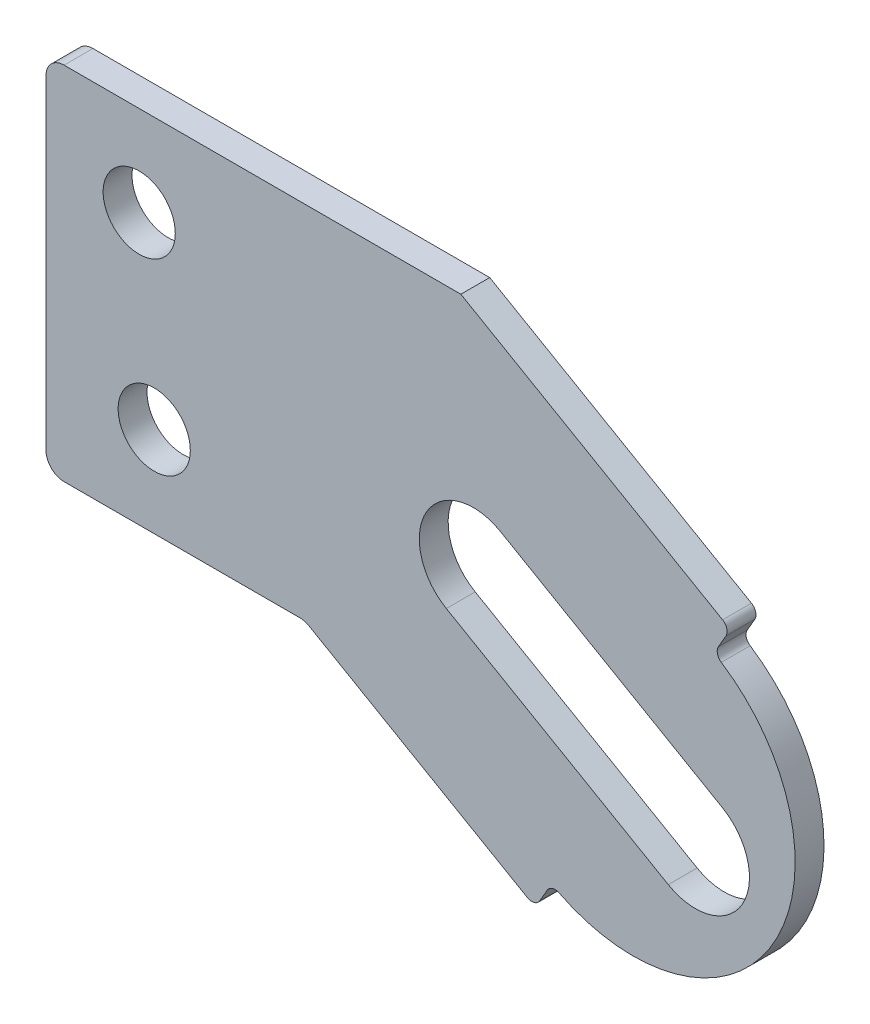
ISO-10303-21;
HEADER;
FILE_DESCRIPTION(('STEP AP214'),'2;1');
FILE_NAME('part.step','',(''),(''),'','','');
FILE_SCHEMA(('AUTOMOTIVE_DESIGN { 1 0 10303 214 1 1 1 1 }'));
ENDSEC;
DATA;
#1=APPLICATION_CONTEXT('core data for automotive mechanical design processes');
#2=APPLICATION_PROTOCOL_DEFINITION('international standard','automotive_design',2000,#1);
#3=PRODUCT_CONTEXT('',#1,'mechanical');
#4=PRODUCT('Part','Part','',(#3));
#5=PRODUCT_RELATED_PRODUCT_CATEGORY('part','',(#4));
#6=PRODUCT_DEFINITION_FORMATION('','',#4);
#7=PRODUCT_DEFINITION_CONTEXT('part definition',#1,'design');
#8=PRODUCT_DEFINITION('design','',#6,#7);
#9=PRODUCT_DEFINITION_SHAPE('','',#8);
#10=(LENGTH_UNIT() NAMED_UNIT(*) SI_UNIT(.MILLI.,.METRE.));
#11=(NAMED_UNIT(*) PLANE_ANGLE_UNIT() SI_UNIT($,.RADIAN.));
#12=(NAMED_UNIT(*) SI_UNIT($,.STERADIAN.) SOLID_ANGLE_UNIT());
#13=UNCERTAINTY_MEASURE_WITH_UNIT(LENGTH_MEASURE(1.E-05),#10,'distance_accuracy_value','');
#14=(GEOMETRIC_REPRESENTATION_CONTEXT(3) GLOBAL_UNCERTAINTY_ASSIGNED_CONTEXT((#13)) GLOBAL_UNIT_ASSIGNED_CONTEXT((#10,
#11,#12)) REPRESENTATION_CONTEXT('',''));
#15=CARTESIAN_POINT('',(0.,0.,0.));
#16=DIRECTION('',(0.,0.,1.));
#17=DIRECTION('',(1.,0.,0.));
#18=AXIS2_PLACEMENT_3D('',#15,#16,#17);
#19=CARTESIAN_POINT('',(0.15720945239991,1.39829475898672,0.2));
#20=DIRECTION('',(0.,0.,1.));
#21=DIRECTION('',(1.,0.,0.));
#22=AXIS2_PLACEMENT_3D('',#19,#20,#21);
#23=PLANE('',#22);
#24=CARTESIAN_POINT('',(-3.85411977486092,1.875,0.2));
#25=DIRECTION('',(0.,0.,1.));
#26=DIRECTION('',(1.,0.,0.));
#27=AXIS2_PLACEMENT_3D('',#24,#25,#26);
#28=CIRCLE('',#27,0.25);
#29=CARTESIAN_POINT('',(-3.60411977486092,1.875,0.2));
#30=VERTEX_POINT('',#29);
#31=EDGE_CURVE('E227',#30,#30,#28,.T.);
#32=ORIENTED_EDGE('',*,*,#31,.F.);
#33=EDGE_LOOP('',(#32));
#34=FACE_BOUND('',#33,.T.);
#35=DIRECTION('',(-0.866025403784438,0.500000000000001,0.));
#36=VECTOR('',#35,1.);
#37=CARTESIAN_POINT('',(-1.625,2.5,0.2));
#38=LINE('',#37,#36);
#39=CARTESIAN_POINT('',(0.188709452399909,1.45285435942514,0.2));
#40=VERTEX_POINT('',#39);
#41=CARTESIAN_POINT('',(-1.625,2.5,0.2));
#42=VERTEX_POINT('',#41);
#43=EDGE_CURVE('E235',#40,#42,#38,.T.);
#44=ORIENTED_EDGE('',*,*,#43,.T.);
#45=DIRECTION('',(-1.,0.,0.));
#46=VECTOR('',#45,1.);
#47=CARTESIAN_POINT('',(-4.375,2.5,0.2));
#48=LINE('',#47,#46);
#49=CARTESIAN_POINT('',(-4.375,2.5,0.2));
#50=VERTEX_POINT('',#49);
#51=EDGE_CURVE('E239',#42,#50,#48,.T.);
#52=ORIENTED_EDGE('',*,*,#51,.T.);
#53=CARTESIAN_POINT('',(-4.375,2.375,0.2));
#54=DIRECTION('',(0.,0.,1.));
#55=DIRECTION('',(-1.,0.,0.));
#56=AXIS2_PLACEMENT_3D('',#53,#54,#55);
#57=CIRCLE('',#56,0.125);
#58=CARTESIAN_POINT('',(-4.5,2.375,0.2));
#59=VERTEX_POINT('',#58);
#60=EDGE_CURVE('E243',#50,#59,#57,.T.);
#61=ORIENTED_EDGE('',*,*,#60,.T.);
#62=DIRECTION('',(0.,-1.,0.));
#63=VECTOR('',#62,1.);
#64=CARTESIAN_POINT('',(-4.5,2.375,0.2));
#65=LINE('',#64,#63);
#66=CARTESIAN_POINT('',(-4.5,0.125000000000001,0.2));
#67=VERTEX_POINT('',#66);
#68=EDGE_CURVE('E246',#59,#67,#65,.T.);
#69=ORIENTED_EDGE('',*,*,#68,.T.);
#70=CARTESIAN_POINT('',(-4.375,0.125,0.2));
#71=DIRECTION('',(0.,0.,1.));
#72=DIRECTION('',(1.,0.,0.));
#73=AXIS2_PLACEMENT_3D('',#70,#71,#72);
#74=CIRCLE('',#73,0.125);
#75=CARTESIAN_POINT('',(-4.375,0.,0.2));
#76=VERTEX_POINT('',#75);
#77=EDGE_CURVE('E249',#67,#76,#74,.T.);
#78=ORIENTED_EDGE('',*,*,#77,.T.);
#79=DIRECTION('',(1.,0.,0.));
#80=VECTOR('',#79,1.);
#81=CARTESIAN_POINT('',(-4.375,0.,0.2));
#82=LINE('',#81,#80);
#83=CARTESIAN_POINT('',(-2.7403666301317,0.,0.2));
#84=VERTEX_POINT('',#83);
#85=EDGE_CURVE('E252',#76,#84,#82,.T.);
#86=ORIENTED_EDGE('',*,*,#85,.T.);
#87=CARTESIAN_POINT('',(-2.7403666301317,-0.125,0.2));
#88=DIRECTION('',(0.,0.,-1.));
#89=DIRECTION('',(-1.,0.,0.));
#90=AXIS2_PLACEMENT_3D('',#87,#88,#89);
#91=CIRCLE('',#90,0.125);
#92=CARTESIAN_POINT('',(-2.6778666301317,-0.0167468245269457,0.2));
#93=VERTEX_POINT('',#92);
#94=EDGE_CURVE('E255',#84,#93,#91,.T.);
#95=ORIENTED_EDGE('',*,*,#94,.T.);
#96=DIRECTION('',(0.866025403784438,-0.500000000000001,0.));
#97=VECTOR('',#96,1.);
#98=CARTESIAN_POINT('',(-2.6778666301317,-0.0167468245269454,0.2));
#99=LINE('',#98,#97);
#100=CARTESIAN_POINT('',(-1.16429054760009,-0.890610383215549,0.2));
#101=VERTEX_POINT('',#100);
#102=EDGE_CURVE('E258',#93,#101,#99,.T.);
#103=ORIENTED_EDGE('',*,*,#102,.T.);
#104=CARTESIAN_POINT('',(-1.13279054760009,-0.836050782777129,0.2));
#105=DIRECTION('',(0.,0.,1.));
#106=DIRECTION('',(1.,0.,0.));
#107=AXIS2_PLACEMENT_3D('',#104,#105,#106);
#108=CIRCLE('',#107,0.0629999999999999);
#109=CARTESIAN_POINT('',(-1.07823094716167,-0.867550782777129,0.2));
#110=VERTEX_POINT('',#109);
#111=EDGE_CURVE('E261',#101,#110,#108,.T.);
#112=ORIENTED_EDGE('',*,*,#111,.T.);
#113=DIRECTION('',(0.5,0.866025403784439,0.));
#114=VECTOR('',#113,1.);
#115=CARTESIAN_POINT('',(-1.07823094716167,-0.867550782777129,0.2));
#116=LINE('',#115,#114);
#117=CARTESIAN_POINT('',(-1.02639513185256,-0.777768517009981,0.2));
#118=VERTEX_POINT('',#117);
#119=EDGE_CURVE('E264',#110,#118,#116,.T.);
#120=ORIENTED_EDGE('',*,*,#119,.T.);
#121=CARTESIAN_POINT('',(-0.971835531414136,-0.809268517009981,0.2));
#122=DIRECTION('',(0.,0.,-1.));
#123=DIRECTION('',(1.,0.,0.));
#124=AXIS2_PLACEMENT_3D('',#121,#122,#123);
#125=CIRCLE('',#124,0.0629999999999999);
#126=CARTESIAN_POINT('',(-0.943273167097718,-0.753115232647834,0.2));
#127=VERTEX_POINT('',#126);
#128=EDGE_CURVE('E267',#118,#127,#125,.T.);
#129=ORIENTED_EDGE('',*,*,#128,.T.);
#130=CARTESIAN_POINT('',(-0.433230947161672,0.249621988104797,0.2));
#131=DIRECTION('',(0.,0.,1.));
#132=DIRECTION('',(-1.,0.,0.));
#133=AXIS2_PLACEMENT_3D('',#130,#131,#132);
#134=CIRCLE('',#133,1.125);
#135=CARTESIAN_POINT('',(0.180143849362289,1.19270011794834,0.2));
#136=VERTEX_POINT('',#135);
#137=EDGE_CURVE('E270',#127,#136,#134,.T.);
#138=ORIENTED_EDGE('',*,*,#137,.T.);
#139=CARTESIAN_POINT('',(0.214492837967631,1.24551249321957,0.2));
#140=DIRECTION('',(0.,0.,-1.));
#141=DIRECTION('',(1.,0.,0.));
#142=AXIS2_PLACEMENT_3D('',#139,#140,#141);
#143=CIRCLE('',#142,0.0630000000000001);
#144=CARTESIAN_POINT('',(0.159933237529212,1.27701249321957,0.2));
#145=VERTEX_POINT('',#144);
#146=EDGE_CURVE('E273',#136,#145,#143,.T.);
#147=ORIENTED_EDGE('',*,*,#146,.T.);
#148=DIRECTION('',(0.500000000000001,0.866025403784438,0.));
#149=VECTOR('',#148,1.);
#150=CARTESIAN_POINT('',(0.211769052838329,1.36679475898672,0.2));
#151=LINE('',#150,#149);
#152=CARTESIAN_POINT('',(0.211769052838329,1.36679475898672,0.2));
#153=VERTEX_POINT('',#152);
#154=EDGE_CURVE('E276',#145,#153,#151,.T.);
#155=ORIENTED_EDGE('',*,*,#154,.T.);
#156=CARTESIAN_POINT('',(0.15720945239991,1.39829475898672,0.2));
#157=DIRECTION('',(0.,0.,1.));
#158=DIRECTION('',(1.,0.,0.));
#159=AXIS2_PLACEMENT_3D('',#156,#157,#158);
#160=CIRCLE('',#159,0.0629999999999997);
#161=EDGE_CURVE('E279',#153,#40,#160,.T.);
#162=ORIENTED_EDGE('',*,*,#161,.T.);
#163=EDGE_LOOP('',(#44,#52,#61,#69,#78,#86,#95,#103,#112,#120,#129,#138,#147,#155,#162));
#164=FACE_BOUND('',#163,.T.);
#165=CARTESIAN_POINT('',(-3.75,0.625,0.2));
#166=DIRECTION('',(0.,0.,1.));
#167=DIRECTION('',(1.,0.,0.));
#168=AXIS2_PLACEMENT_3D('',#165,#166,#167);
#169=CIRCLE('',#168,0.25);
#170=CARTESIAN_POINT('',(-3.5,0.625,0.2));
#171=VERTEX_POINT('',#170);
#172=EDGE_CURVE('E219',#171,#171,#169,.T.);
#173=ORIENTED_EDGE('',*,*,#172,.F.);
#174=EDGE_LOOP('',(#173));
#175=FACE_BOUND('',#174,.T.);
#176=DIRECTION('',(-0.866025403784438,0.500000000000001,0.));
#177=VECTOR('',#176,1.);
#178=CARTESIAN_POINT('',(0.1875,0.324759526419164,0.2));
#179=LINE('',#178,#177);
#180=CARTESIAN_POINT('',(0.1875,0.324759526419164,0.2));
#181=VERTEX_POINT('',#180);
#182=CARTESIAN_POINT('',(-1.35059503581098,1.21277910938386,0.2));
#183=VERTEX_POINT('',#182);
#184=EDGE_CURVE('E180',#181,#183,#179,.T.);
#185=ORIENTED_EDGE('',*,*,#184,.F.);
#186=CARTESIAN_POINT('',(0.,0.,0.2));
#187=DIRECTION('',(0.,0.,1.));
#188=DIRECTION('',(1.,0.,0.));
#189=AXIS2_PLACEMENT_3D('',#186,#187,#188);
#190=CIRCLE('',#189,0.375);
#191=CARTESIAN_POINT('',(-0.1875,-0.324759526419164,0.2));
#192=VERTEX_POINT('',#191);
#193=EDGE_CURVE('E171',#192,#181,#190,.T.);
#194=ORIENTED_EDGE('',*,*,#193,.F.);
#195=DIRECTION('',(0.866025403784438,-0.500000000000001,0.));
#196=VECTOR('',#195,1.);
#197=CARTESIAN_POINT('',(-0.1875,-0.324759526419164,0.2));
#198=LINE('',#197,#196);
#199=CARTESIAN_POINT('',(-1.72559503581098,0.563260056545533,0.2));
#200=VERTEX_POINT('',#199);
#201=EDGE_CURVE('E197',#200,#192,#198,.T.);
#202=ORIENTED_EDGE('',*,*,#201,.F.);
#203=CARTESIAN_POINT('',(-1.53809503581098,0.888019582964697,0.2));
#204=DIRECTION('',(0.,0.,1.));
#205=DIRECTION('',(1.,0.,0.));
#206=AXIS2_PLACEMENT_3D('',#203,#204,#205);
#207=CIRCLE('',#206,0.375);
#208=EDGE_CURVE('E193',#183,#200,#207,.T.);
#209=ORIENTED_EDGE('',*,*,#208,.F.);
#210=EDGE_LOOP('',(#185,#194,#202,#209));
#211=FACE_BOUND('',#210,.T.);
#212=ADVANCED_FACE('F39',(#34,#164,#175,#211),#23,.T.);
#213=CARTESIAN_POINT('',(0.15720945239991,1.39829475898672,0.));
#214=DIRECTION('',(0.,0.,1.));
#215=DIRECTION('',(1.,0.,0.));
#216=AXIS2_PLACEMENT_3D('',#213,#214,#215);
#217=PLANE('',#216);
#218=CARTESIAN_POINT('',(-3.75,0.625,0.));
#219=DIRECTION('',(0.,0.,1.));
#220=DIRECTION('',(1.,0.,0.));
#221=AXIS2_PLACEMENT_3D('',#218,#219,#220);
#222=CIRCLE('',#221,0.25);
#223=CARTESIAN_POINT('',(-3.5,0.625,0.));
#224=VERTEX_POINT('',#223);
#225=EDGE_CURVE('E189',#224,#224,#222,.T.);
#226=ORIENTED_EDGE('',*,*,#225,.T.);
#227=EDGE_LOOP('',(#226));
#228=FACE_BOUND('',#227,.T.);
#229=CARTESIAN_POINT('',(-3.85411977486092,1.875,0.));
#230=DIRECTION('',(0.,0.,1.));
#231=DIRECTION('',(1.,0.,0.));
#232=AXIS2_PLACEMENT_3D('',#229,#230,#231);
#233=CIRCLE('',#232,0.25);
#234=CARTESIAN_POINT('',(-3.60411977486092,1.875,0.));
#235=VERTEX_POINT('',#234);
#236=EDGE_CURVE('E223',#235,#235,#233,.T.);
#237=ORIENTED_EDGE('',*,*,#236,.T.);
#238=EDGE_LOOP('',(#237));
#239=FACE_BOUND('',#238,.T.);
#240=DIRECTION('',(-0.866025403784438,0.500000000000001,0.));
#241=VECTOR('',#240,1.);
#242=CARTESIAN_POINT('',(-1.625,2.5,0.));
#243=LINE('',#242,#241);
#244=CARTESIAN_POINT('',(0.188709452399909,1.45285435942514,0.));
#245=VERTEX_POINT('',#244);
#246=CARTESIAN_POINT('',(-1.625,2.5,0.));
#247=VERTEX_POINT('',#246);
#248=EDGE_CURVE('E231',#245,#247,#243,.T.);
#249=ORIENTED_EDGE('',*,*,#248,.F.);
#250=CARTESIAN_POINT('',(0.15720945239991,1.39829475898672,0.));
#251=DIRECTION('',(0.,0.,1.));
#252=DIRECTION('',(1.,0.,0.));
#253=AXIS2_PLACEMENT_3D('',#250,#251,#252);
#254=CIRCLE('',#253,0.0629999999999997);
#255=CARTESIAN_POINT('',(0.211769052838329,1.36679475898672,0.));
#256=VERTEX_POINT('',#255);
#257=EDGE_CURVE('E240',#256,#245,#254,.T.);
#258=ORIENTED_EDGE('',*,*,#257,.F.);
#259=DIRECTION('',(0.500000000000001,0.866025403784438,0.));
#260=VECTOR('',#259,1.);
#261=CARTESIAN_POINT('',(0.211769052838329,1.36679475898672,0.));
#262=LINE('',#261,#260);
#263=CARTESIAN_POINT('',(0.159933237529212,1.27701249321957,0.));
#264=VERTEX_POINT('',#263);
#265=EDGE_CURVE('E322',#264,#256,#262,.T.);
#266=ORIENTED_EDGE('',*,*,#265,.F.);
#267=CARTESIAN_POINT('',(0.214492837967631,1.24551249321957,0.));
#268=DIRECTION('',(0.,0.,-1.));
#269=DIRECTION('',(1.,0.,0.));
#270=AXIS2_PLACEMENT_3D('',#267,#268,#269);
#271=CIRCLE('',#270,0.0630000000000001);
#272=CARTESIAN_POINT('',(0.180143849362289,1.19270011794834,0.));
#273=VERTEX_POINT('',#272);
#274=EDGE_CURVE('E319',#273,#264,#271,.T.);
#275=ORIENTED_EDGE('',*,*,#274,.F.);
#276=CARTESIAN_POINT('',(-0.433230947161672,0.249621988104797,0.));
#277=DIRECTION('',(0.,0.,1.));
#278=DIRECTION('',(-1.,0.,0.));
#279=AXIS2_PLACEMENT_3D('',#276,#277,#278);
#280=CIRCLE('',#279,1.125);
#281=CARTESIAN_POINT('',(-0.943273167097718,-0.753115232647834,0.));
#282=VERTEX_POINT('',#281);
#283=EDGE_CURVE('E316',#282,#273,#280,.T.);
#284=ORIENTED_EDGE('',*,*,#283,.F.);
#285=CARTESIAN_POINT('',(-0.971835531414136,-0.809268517009981,0.));
#286=DIRECTION('',(0.,0.,-1.));
#287=DIRECTION('',(1.,0.,0.));
#288=AXIS2_PLACEMENT_3D('',#285,#286,#287);
#289=CIRCLE('',#288,0.0629999999999999);
#290=CARTESIAN_POINT('',(-1.02639513185256,-0.777768517009981,0.));
#291=VERTEX_POINT('',#290);
#292=EDGE_CURVE('E313',#291,#282,#289,.T.);
#293=ORIENTED_EDGE('',*,*,#292,.F.);
#294=DIRECTION('',(0.5,0.866025403784439,0.));
#295=VECTOR('',#294,1.);
#296=CARTESIAN_POINT('',(-1.07823094716167,-0.867550782777129,0.));
#297=LINE('',#296,#295);
#298=CARTESIAN_POINT('',(-1.07823094716167,-0.867550782777129,0.));
#299=VERTEX_POINT('',#298);
#300=EDGE_CURVE('E310',#299,#291,#297,.T.);
#301=ORIENTED_EDGE('',*,*,#300,.F.);
#302=CARTESIAN_POINT('',(-1.13279054760009,-0.836050782777129,0.));
#303=DIRECTION('',(0.,0.,1.));
#304=DIRECTION('',(1.,0.,0.));
#305=AXIS2_PLACEMENT_3D('',#302,#303,#304);
#306=CIRCLE('',#305,0.0629999999999999);
#307=CARTESIAN_POINT('',(-1.16429054760009,-0.890610383215549,0.));
#308=VERTEX_POINT('',#307);
#309=EDGE_CURVE('E307',#308,#299,#306,.T.);
#310=ORIENTED_EDGE('',*,*,#309,.F.);
#311=DIRECTION('',(0.866025403784438,-0.500000000000001,0.));
#312=VECTOR('',#311,1.);
#313=CARTESIAN_POINT('',(-2.6778666301317,-0.0167468245269454,0.));
#314=LINE('',#313,#312);
#315=CARTESIAN_POINT('',(-2.6778666301317,-0.0167468245269457,0.));
#316=VERTEX_POINT('',#315);
#317=EDGE_CURVE('E304',#316,#308,#314,.T.);
#318=ORIENTED_EDGE('',*,*,#317,.F.);
#319=CARTESIAN_POINT('',(-2.7403666301317,-0.125,0.));
#320=DIRECTION('',(0.,0.,-1.));
#321=DIRECTION('',(-1.,0.,0.));
#322=AXIS2_PLACEMENT_3D('',#319,#320,#321);
#323=CIRCLE('',#322,0.125);
#324=CARTESIAN_POINT('',(-2.7403666301317,0.,0.));
#325=VERTEX_POINT('',#324);
#326=EDGE_CURVE('E301',#325,#316,#323,.T.);
#327=ORIENTED_EDGE('',*,*,#326,.F.);
#328=DIRECTION('',(1.,0.,0.));
#329=VECTOR('',#328,1.);
#330=CARTESIAN_POINT('',(-4.375,0.,0.));
#331=LINE('',#330,#329);
#332=CARTESIAN_POINT('',(-4.375,0.,0.));
#333=VERTEX_POINT('',#332);
#334=EDGE_CURVE('E298',#333,#325,#331,.T.);
#335=ORIENTED_EDGE('',*,*,#334,.F.);
#336=CARTESIAN_POINT('',(-4.375,0.125,0.));
#337=DIRECTION('',(0.,0.,1.));
#338=DIRECTION('',(1.,0.,0.));
#339=AXIS2_PLACEMENT_3D('',#336,#337,#338);
#340=CIRCLE('',#339,0.125);
#341=CARTESIAN_POINT('',(-4.5,0.125000000000001,0.));
#342=VERTEX_POINT('',#341);
#343=EDGE_CURVE('E295',#342,#333,#340,.T.);
#344=ORIENTED_EDGE('',*,*,#343,.F.);
#345=DIRECTION('',(0.,-1.,0.));
#346=VECTOR('',#345,1.);
#347=CARTESIAN_POINT('',(-4.5,2.375,0.));
#348=LINE('',#347,#346);
#349=CARTESIAN_POINT('',(-4.5,2.375,0.));
#350=VERTEX_POINT('',#349);
#351=EDGE_CURVE('E292',#350,#342,#348,.T.);
#352=ORIENTED_EDGE('',*,*,#351,.F.);
#353=CARTESIAN_POINT('',(-4.375,2.375,0.));
#354=DIRECTION('',(0.,0.,1.));
#355=DIRECTION('',(-1.,0.,0.));
#356=AXIS2_PLACEMENT_3D('',#353,#354,#355);
#357=CIRCLE('',#356,0.125);
#358=CARTESIAN_POINT('',(-4.375,2.5,0.));
#359=VERTEX_POINT('',#358);
#360=EDGE_CURVE('E289',#359,#350,#357,.T.);
#361=ORIENTED_EDGE('',*,*,#360,.F.);
#362=DIRECTION('',(-1.,0.,0.));
#363=VECTOR('',#362,1.);
#364=CARTESIAN_POINT('',(-4.375,2.5,0.));
#365=LINE('',#364,#363);
#366=EDGE_CURVE('E286',#247,#359,#365,.T.);
#367=ORIENTED_EDGE('',*,*,#366,.F.);
#368=EDGE_LOOP('',(#249,#258,#266,#275,#284,#293,#301,#310,#318,#327,#335,#344,#352,#361,#367));
#369=FACE_BOUND('',#368,.T.);
#370=CARTESIAN_POINT('',(0.,0.,0.));
#371=DIRECTION('',(0.,0.,1.));
#372=DIRECTION('',(1.,0.,0.));
#373=AXIS2_PLACEMENT_3D('',#370,#371,#372);
#374=CIRCLE('',#373,0.375);
#375=CARTESIAN_POINT('',(-0.1875,-0.324759526419164,0.));
#376=VERTEX_POINT('',#375);
#377=CARTESIAN_POINT('',(0.1875,0.324759526419164,0.));
#378=VERTEX_POINT('',#377);
#379=EDGE_CURVE('E63',#376,#378,#374,.T.);
#380=ORIENTED_EDGE('',*,*,#379,.T.);
#381=DIRECTION('',(-0.866025403784438,0.500000000000001,0.));
#382=VECTOR('',#381,1.);
#383=CARTESIAN_POINT('',(0.1875,0.324759526419164,0.));
#384=LINE('',#383,#382);
#385=CARTESIAN_POINT('',(-1.35059503581098,1.21277910938386,0.));
#386=VERTEX_POINT('',#385);
#387=EDGE_CURVE('E187',#378,#386,#384,.T.);
#388=ORIENTED_EDGE('',*,*,#387,.T.);
#389=CARTESIAN_POINT('',(-1.53809503581098,0.888019582964697,0.));
#390=DIRECTION('',(0.,0.,1.));
#391=DIRECTION('',(1.,0.,0.));
#392=AXIS2_PLACEMENT_3D('',#389,#390,#391);
#393=CIRCLE('',#392,0.375);
#394=CARTESIAN_POINT('',(-1.72559503581098,0.563260056545533,0.));
#395=VERTEX_POINT('',#394);
#396=EDGE_CURVE('E206',#386,#395,#393,.T.);
#397=ORIENTED_EDGE('',*,*,#396,.T.);
#398=DIRECTION('',(0.866025403784438,-0.500000000000001,0.));
#399=VECTOR('',#398,1.);
#400=CARTESIAN_POINT('',(-0.1875,-0.324759526419164,0.));
#401=LINE('',#400,#399);
#402=EDGE_CURVE('E181',#395,#376,#401,.T.);
#403=ORIENTED_EDGE('',*,*,#402,.T.);
#404=EDGE_LOOP('',(#380,#388,#397,#403));
#405=FACE_BOUND('',#404,.T.);
#406=ADVANCED_FACE('F389',(#228,#239,#369,#405),#217,.F.);
#407=CARTESIAN_POINT('',(-1.625,2.5,0.2));
#408=DIRECTION('',(-0.500000000000001,-0.866025403784438,0.));
#409=DIRECTION('',(0.866025403784438,-0.500000000000001,0.));
#410=AXIS2_PLACEMENT_3D('',#407,#408,#409);
#411=PLANE('',#410);
#412=ORIENTED_EDGE('',*,*,#248,.T.);
#413=DIRECTION('',(0.,0.,-1.));
#414=VECTOR('',#413,1.);
#415=CARTESIAN_POINT('',(-1.625,2.5,0.2));
#416=LINE('',#415,#414);
#417=EDGE_CURVE('E11',#42,#247,#416,.T.);
#418=ORIENTED_EDGE('',*,*,#417,.F.);
#419=ORIENTED_EDGE('',*,*,#43,.F.);
#420=DIRECTION('',(0.,0.,-1.));
#421=VECTOR('',#420,1.);
#422=CARTESIAN_POINT('',(0.188709452399909,1.45285435942514,0.2));
#423=LINE('',#422,#421);
#424=EDGE_CURVE('E282',#40,#245,#423,.T.);
#425=ORIENTED_EDGE('',*,*,#424,.T.);
#426=EDGE_LOOP('',(#412,#418,#419,#425));
#427=FACE_BOUND('',#426,.T.);
#428=ADVANCED_FACE('F41',(#427),#411,.F.);
#429=CARTESIAN_POINT('',(-4.375,2.5,0.2));
#430=DIRECTION('',(0.,-1.,0.));
#431=DIRECTION('',(0.,0.,-1.));
#432=AXIS2_PLACEMENT_3D('',#429,#430,#431);
#433=PLANE('',#432);
#434=ORIENTED_EDGE('',*,*,#366,.T.);
#435=DIRECTION('',(0.,0.,-1.));
#436=VECTOR('',#435,1.);
#437=CARTESIAN_POINT('',(-4.375,2.5,0.2));
#438=LINE('',#437,#436);
#439=EDGE_CURVE('E48',#50,#359,#438,.T.);
#440=ORIENTED_EDGE('',*,*,#439,.F.);
#441=ORIENTED_EDGE('',*,*,#51,.F.);
#442=ORIENTED_EDGE('',*,*,#417,.T.);
#443=EDGE_LOOP('',(#434,#440,#441,#442));
#444=FACE_BOUND('',#443,.T.);
#445=ADVANCED_FACE('F407',(#444),#433,.F.);
#446=CARTESIAN_POINT('',(-4.375,2.375,0.2));
#447=DIRECTION('',(0.,0.,-1.));
#448=DIRECTION('',(-1.,0.,0.));
#449=AXIS2_PLACEMENT_3D('',#446,#447,#448);
#450=CYLINDRICAL_SURFACE('',#449,0.125);
#451=ORIENTED_EDGE('',*,*,#360,.T.);
#452=DIRECTION('',(0.,0.,-1.));
#453=VECTOR('',#452,1.);
#454=CARTESIAN_POINT('',(-4.5,2.375,0.2));
#455=LINE('',#454,#453);
#456=EDGE_CURVE('E374',#59,#350,#455,.T.);
#457=ORIENTED_EDGE('',*,*,#456,.F.);
#458=ORIENTED_EDGE('',*,*,#60,.F.);
#459=ORIENTED_EDGE('',*,*,#439,.T.);
#460=EDGE_LOOP('',(#451,#457,#458,#459));
#461=FACE_BOUND('',#460,.T.);
#462=ADVANCED_FACE('F383',(#461),#450,.T.);
#463=CARTESIAN_POINT('',(-4.5,2.375,0.2));
#464=DIRECTION('',(1.,0.,0.));
#465=DIRECTION('',(0.,0.,-1.));
#466=AXIS2_PLACEMENT_3D('',#463,#464,#465);
#467=PLANE('',#466);
#468=ORIENTED_EDGE('',*,*,#351,.T.);
#469=DIRECTION('',(0.,0.,-1.));
#470=VECTOR('',#469,1.);
#471=CARTESIAN_POINT('',(-4.5,0.125000000000001,0.2));
#472=LINE('',#471,#470);
#473=EDGE_CURVE('E370',#67,#342,#472,.T.);
#474=ORIENTED_EDGE('',*,*,#473,.F.);
#475=ORIENTED_EDGE('',*,*,#68,.F.);
#476=ORIENTED_EDGE('',*,*,#456,.T.);
#477=EDGE_LOOP('',(#468,#474,#475,#476));
#478=FACE_BOUND('',#477,.T.);
#479=ADVANCED_FACE('F395',(#478),#467,.F.);
#480=CARTESIAN_POINT('',(-4.375,0.125,0.2));
#481=DIRECTION('',(0.,0.,-1.));
#482=DIRECTION('',(-1.,0.,0.));
#483=AXIS2_PLACEMENT_3D('',#480,#481,#482);
#484=CYLINDRICAL_SURFACE('',#483,0.125);
#485=ORIENTED_EDGE('',*,*,#343,.T.);
#486=DIRECTION('',(0.,0.,-1.));
#487=VECTOR('',#486,1.);
#488=CARTESIAN_POINT('',(-4.375,0.,0.2));
#489=LINE('',#488,#487);
#490=EDGE_CURVE('E366',#76,#333,#489,.T.);
#491=ORIENTED_EDGE('',*,*,#490,.F.);
#492=ORIENTED_EDGE('',*,*,#77,.F.);
#493=ORIENTED_EDGE('',*,*,#473,.T.);
#494=EDGE_LOOP('',(#485,#491,#492,#493));
#495=FACE_BOUND('',#494,.T.);
#496=ADVANCED_FACE('F399',(#495),#484,.T.);
#497=CARTESIAN_POINT('',(-4.375,0.,0.2));
#498=DIRECTION('',(0.,1.,0.));
#499=DIRECTION('',(-1.,0.,0.));
#500=AXIS2_PLACEMENT_3D('',#497,#498,#499);
#501=PLANE('',#500);
#502=ORIENTED_EDGE('',*,*,#334,.T.);
#503=DIRECTION('',(0.,0.,-1.));
#504=VECTOR('',#503,1.);
#505=CARTESIAN_POINT('',(-2.7403666301317,0.,0.2));
#506=LINE('',#505,#504);
#507=EDGE_CURVE('E362',#84,#325,#506,.T.);
#508=ORIENTED_EDGE('',*,*,#507,.F.);
#509=ORIENTED_EDGE('',*,*,#85,.F.);
#510=ORIENTED_EDGE('',*,*,#490,.T.);
#511=EDGE_LOOP('',(#502,#508,#509,#510));
#512=FACE_BOUND('',#511,.T.);
#513=ADVANCED_FACE('F455',(#512),#501,.F.);
#514=CARTESIAN_POINT('',(-2.7403666301317,-0.125,0.2));
#515=DIRECTION('',(0.,0.,-1.));
#516=DIRECTION('',(-1.,0.,0.));
#517=AXIS2_PLACEMENT_3D('',#514,#515,#516);
#518=CYLINDRICAL_SURFACE('',#517,0.125);
#519=ORIENTED_EDGE('',*,*,#326,.T.);
#520=DIRECTION('',(0.,0.,-1.));
#521=VECTOR('',#520,1.);
#522=CARTESIAN_POINT('',(-2.6778666301317,-0.0167468245269457,0.2));
#523=LINE('',#522,#521);
#524=EDGE_CURVE('E358',#93,#316,#523,.T.);
#525=ORIENTED_EDGE('',*,*,#524,.F.);
#526=ORIENTED_EDGE('',*,*,#94,.F.);
#527=ORIENTED_EDGE('',*,*,#507,.T.);
#528=EDGE_LOOP('',(#519,#525,#526,#527));
#529=FACE_BOUND('',#528,.T.);
#530=ADVANCED_FACE('F453',(#529),#518,.F.);
#531=CARTESIAN_POINT('',(-2.6778666301317,-0.0167468245269454,0.2));
#532=DIRECTION('',(0.500000000000001,0.866025403784438,0.));
#533=DIRECTION('',(-0.866025403784438,0.500000000000001,0.));
#534=AXIS2_PLACEMENT_3D('',#531,#532,#533);
#535=PLANE('',#534);
#536=ORIENTED_EDGE('',*,*,#317,.T.);
#537=DIRECTION('',(0.,0.,-1.));
#538=VECTOR('',#537,1.);
#539=CARTESIAN_POINT('',(-1.16429054760009,-0.890610383215549,0.2));
#540=LINE('',#539,#538);
#541=EDGE_CURVE('E354',#101,#308,#540,.T.);
#542=ORIENTED_EDGE('',*,*,#541,.F.);
#543=ORIENTED_EDGE('',*,*,#102,.F.);
#544=ORIENTED_EDGE('',*,*,#524,.T.);
#545=EDGE_LOOP('',(#536,#542,#543,#544));
#546=FACE_BOUND('',#545,.T.);
#547=ADVANCED_FACE('F449',(#546),#535,.F.);
#548=CARTESIAN_POINT('',(-1.13279054760009,-0.836050782777129,0.2));
#549=DIRECTION('',(0.,0.,-1.));
#550=DIRECTION('',(-1.,0.,0.));
#551=AXIS2_PLACEMENT_3D('',#548,#549,#550);
#552=CYLINDRICAL_SURFACE('',#551,0.0629999999999999);
#553=ORIENTED_EDGE('',*,*,#309,.T.);
#554=DIRECTION('',(0.,0.,-1.));
#555=VECTOR('',#554,1.);
#556=CARTESIAN_POINT('',(-1.07823094716167,-0.867550782777129,0.2));
#557=LINE('',#556,#555);
#558=EDGE_CURVE('E350',#110,#299,#557,.T.);
#559=ORIENTED_EDGE('',*,*,#558,.F.);
#560=ORIENTED_EDGE('',*,*,#111,.F.);
#561=ORIENTED_EDGE('',*,*,#541,.T.);
#562=EDGE_LOOP('',(#553,#559,#560,#561));
#563=FACE_BOUND('',#562,.T.);
#564=ADVANCED_FACE('F444',(#563),#552,.T.);
#565=CARTESIAN_POINT('',(-1.07823094716167,-0.867550782777129,0.2));
#566=DIRECTION('',(-0.866025403784439,0.5,0.));
#567=DIRECTION('',(-0.5,-0.866025403784439,0.));
#568=AXIS2_PLACEMENT_3D('',#565,#566,#567);
#569=PLANE('',#568);
#570=ORIENTED_EDGE('',*,*,#300,.T.);
#571=DIRECTION('',(0.,0.,-1.));
#572=VECTOR('',#571,1.);
#573=CARTESIAN_POINT('',(-1.02639513185256,-0.777768517009981,0.2));
#574=LINE('',#573,#572);
#575=EDGE_CURVE('E346',#118,#291,#574,.T.);
#576=ORIENTED_EDGE('',*,*,#575,.F.);
#577=ORIENTED_EDGE('',*,*,#119,.F.);
#578=ORIENTED_EDGE('',*,*,#558,.T.);
#579=EDGE_LOOP('',(#570,#576,#577,#578));
#580=FACE_BOUND('',#579,.T.);
#581=ADVANCED_FACE('F438',(#580),#569,.F.);
#582=CARTESIAN_POINT('',(-0.971835531414136,-0.809268517009981,0.2));
#583=DIRECTION('',(0.,0.,-1.));
#584=DIRECTION('',(-1.,0.,0.));
#585=AXIS2_PLACEMENT_3D('',#582,#583,#584);
#586=CYLINDRICAL_SURFACE('',#585,0.0629999999999999);
#587=ORIENTED_EDGE('',*,*,#292,.T.);
#588=DIRECTION('',(0.,0.,-1.));
#589=VECTOR('',#588,1.);
#590=CARTESIAN_POINT('',(-0.943273167097718,-0.753115232647834,0.2));
#591=LINE('',#590,#589);
#592=EDGE_CURVE('E342',#127,#282,#591,.T.);
#593=ORIENTED_EDGE('',*,*,#592,.F.);
#594=ORIENTED_EDGE('',*,*,#128,.F.);
#595=ORIENTED_EDGE('',*,*,#575,.T.);
#596=EDGE_LOOP('',(#587,#593,#594,#595));
#597=FACE_BOUND('',#596,.T.);
#598=ADVANCED_FACE('F434',(#597),#586,.F.);
#599=CARTESIAN_POINT('',(-0.433230947161672,0.249621988104797,0.2));
#600=DIRECTION('',(0.,0.,-1.));
#601=DIRECTION('',(-1.,0.,0.));
#602=AXIS2_PLACEMENT_3D('',#599,#600,#601);
#603=CYLINDRICAL_SURFACE('',#602,1.125);
#604=ORIENTED_EDGE('',*,*,#283,.T.);
#605=DIRECTION('',(0.,0.,-1.));
#606=VECTOR('',#605,1.);
#607=CARTESIAN_POINT('',(0.180143849362289,1.19270011794834,0.2));
#608=LINE('',#607,#606);
#609=EDGE_CURVE('E338',#136,#273,#608,.T.);
#610=ORIENTED_EDGE('',*,*,#609,.F.);
#611=ORIENTED_EDGE('',*,*,#137,.F.);
#612=ORIENTED_EDGE('',*,*,#592,.T.);
#613=EDGE_LOOP('',(#604,#610,#611,#612));
#614=FACE_BOUND('',#613,.T.);
#615=ADVANCED_FACE('F429',(#614),#603,.T.);
#616=CARTESIAN_POINT('',(0.214492837967631,1.24551249321957,0.2));
#617=DIRECTION('',(0.,0.,-1.));
#618=DIRECTION('',(-1.,0.,0.));
#619=AXIS2_PLACEMENT_3D('',#616,#617,#618);
#620=CYLINDRICAL_SURFACE('',#619,0.0630000000000001);
#621=ORIENTED_EDGE('',*,*,#274,.T.);
#622=DIRECTION('',(0.,0.,-1.));
#623=VECTOR('',#622,1.);
#624=CARTESIAN_POINT('',(0.159933237529212,1.27701249321957,0.2));
#625=LINE('',#624,#623);
#626=EDGE_CURVE('E334',#145,#264,#625,.T.);
#627=ORIENTED_EDGE('',*,*,#626,.F.);
#628=ORIENTED_EDGE('',*,*,#146,.F.);
#629=ORIENTED_EDGE('',*,*,#609,.T.);
#630=EDGE_LOOP('',(#621,#627,#628,#629));
#631=FACE_BOUND('',#630,.T.);
#632=ADVANCED_FACE('F423',(#631),#620,.F.);
#633=CARTESIAN_POINT('',(0.211769052838329,1.36679475898672,0.2));
#634=DIRECTION('',(-0.866025403784438,0.500000000000001,0.));
#635=DIRECTION('',(-0.500000000000001,-0.866025403784438,0.));
#636=AXIS2_PLACEMENT_3D('',#633,#634,#635);
#637=PLANE('',#636);
#638=ORIENTED_EDGE('',*,*,#265,.T.);
#639=DIRECTION('',(0.,0.,-1.));
#640=VECTOR('',#639,1.);
#641=CARTESIAN_POINT('',(0.211769052838329,1.36679475898672,0.2));
#642=LINE('',#641,#640);
#643=EDGE_CURVE('E330',#153,#256,#642,.T.);
#644=ORIENTED_EDGE('',*,*,#643,.F.);
#645=ORIENTED_EDGE('',*,*,#154,.F.);
#646=ORIENTED_EDGE('',*,*,#626,.T.);
#647=EDGE_LOOP('',(#638,#644,#645,#646));
#648=FACE_BOUND('',#647,.T.);
#649=ADVANCED_FACE('F419',(#648),#637,.F.);
#650=CARTESIAN_POINT('',(0.15720945239991,1.39829475898672,0.2));
#651=DIRECTION('',(0.,0.,-1.));
#652=DIRECTION('',(-1.,0.,0.));
#653=AXIS2_PLACEMENT_3D('',#650,#651,#652);
#654=CYLINDRICAL_SURFACE('',#653,0.0629999999999997);
#655=ORIENTED_EDGE('',*,*,#257,.T.);
#656=ORIENTED_EDGE('',*,*,#424,.F.);
#657=ORIENTED_EDGE('',*,*,#161,.F.);
#658=ORIENTED_EDGE('',*,*,#643,.T.);
#659=EDGE_LOOP('',(#655,#656,#657,#658));
#660=FACE_BOUND('',#659,.T.);
#661=ADVANCED_FACE('F414',(#660),#654,.T.);
#662=CARTESIAN_POINT('',(-3.85411977486092,1.875,0.2));
#663=DIRECTION('',(0.,0.,-1.));
#664=DIRECTION('',(-1.,0.,0.));
#665=AXIS2_PLACEMENT_3D('',#662,#663,#664);
#666=CYLINDRICAL_SURFACE('',#665,0.25);
#667=ORIENTED_EDGE('',*,*,#31,.T.);
#668=EDGE_LOOP('',(#667));
#669=FACE_BOUND('',#668,.T.);
#670=ORIENTED_EDGE('',*,*,#236,.F.);
#671=EDGE_LOOP('',(#670));
#672=FACE_BOUND('',#671,.T.);
#673=ADVANCED_FACE('F474',(#669,#672),#666,.F.);
#674=CARTESIAN_POINT('',(-3.75,0.625,0.2));
#675=DIRECTION('',(0.,0.,-1.));
#676=DIRECTION('',(-1.,0.,0.));
#677=AXIS2_PLACEMENT_3D('',#674,#675,#676);
#678=CYLINDRICAL_SURFACE('',#677,0.25);
#679=ORIENTED_EDGE('',*,*,#172,.T.);
#680=EDGE_LOOP('',(#679));
#681=FACE_BOUND('',#680,.T.);
#682=ORIENTED_EDGE('',*,*,#225,.F.);
#683=EDGE_LOOP('',(#682));
#684=FACE_BOUND('',#683,.T.);
#685=ADVANCED_FACE('F530',(#681,#684),#678,.F.);
#686=CARTESIAN_POINT('',(0.,0.,0.2));
#687=DIRECTION('',(0.,0.,-1.));
#688=DIRECTION('',(-1.,0.,0.));
#689=AXIS2_PLACEMENT_3D('',#686,#687,#688);
#690=CYLINDRICAL_SURFACE('',#689,0.375);
#691=ORIENTED_EDGE('',*,*,#379,.F.);
#692=DIRECTION('',(0.,0.,-1.));
#693=VECTOR('',#692,1.);
#694=CARTESIAN_POINT('',(-0.1875,-0.324759526419164,0.2));
#695=LINE('',#694,#693);
#696=EDGE_CURVE('E175',#192,#376,#695,.T.);
#697=ORIENTED_EDGE('',*,*,#696,.F.);
#698=ORIENTED_EDGE('',*,*,#193,.T.);
#699=DIRECTION('',(0.,0.,-1.));
#700=VECTOR('',#699,1.);
#701=CARTESIAN_POINT('',(0.1875,0.324759526419164,0.2));
#702=LINE('',#701,#700);
#703=EDGE_CURVE('E174',#181,#378,#702,.T.);
#704=ORIENTED_EDGE('',*,*,#703,.T.);
#705=EDGE_LOOP('',(#691,#697,#698,#704));
#706=FACE_BOUND('',#705,.T.);
#707=ADVANCED_FACE('F173',(#706),#690,.F.);
#708=CARTESIAN_POINT('',(0.1875,0.324759526419164,0.2));
#709=DIRECTION('',(-0.500000000000001,-0.866025403784438,0.));
#710=DIRECTION('',(0.866025403784438,-0.500000000000001,0.));
#711=AXIS2_PLACEMENT_3D('',#708,#709,#710);
#712=PLANE('',#711);
#713=ORIENTED_EDGE('',*,*,#387,.F.);
#714=ORIENTED_EDGE('',*,*,#703,.F.);
#715=ORIENTED_EDGE('',*,*,#184,.T.);
#716=DIRECTION('',(0.,0.,-1.));
#717=VECTOR('',#716,1.);
#718=CARTESIAN_POINT('',(-1.35059503581098,1.21277910938386,0.2));
#719=LINE('',#718,#717);
#720=EDGE_CURVE('E190',#183,#386,#719,.T.);
#721=ORIENTED_EDGE('',*,*,#720,.T.);
#722=EDGE_LOOP('',(#713,#714,#715,#721));
#723=FACE_BOUND('',#722,.T.);
#724=ADVANCED_FACE('F184',(#723),#712,.T.);
#725=CARTESIAN_POINT('',(-1.53809503581098,0.888019582964697,0.2));
#726=DIRECTION('',(0.,0.,-1.));
#727=DIRECTION('',(-1.,0.,0.));
#728=AXIS2_PLACEMENT_3D('',#725,#726,#727);
#729=CYLINDRICAL_SURFACE('',#728,0.375);
#730=ORIENTED_EDGE('',*,*,#396,.F.);
#731=ORIENTED_EDGE('',*,*,#720,.F.);
#732=ORIENTED_EDGE('',*,*,#208,.T.);
#733=DIRECTION('',(0.,0.,-1.));
#734=VECTOR('',#733,1.);
#735=CARTESIAN_POINT('',(-1.72559503581098,0.563260056545533,0.2));
#736=LINE('',#735,#734);
#737=EDGE_CURVE('E55',#200,#395,#736,.T.);
#738=ORIENTED_EDGE('',*,*,#737,.T.);
#739=EDGE_LOOP('',(#730,#731,#732,#738));
#740=FACE_BOUND('',#739,.T.);
#741=ADVANCED_FACE('F549',(#740),#729,.F.);
#742=CARTESIAN_POINT('',(-0.1875,-0.324759526419164,0.2));
#743=DIRECTION('',(0.500000000000001,0.866025403784438,0.));
#744=DIRECTION('',(-0.866025403784438,0.500000000000001,0.));
#745=AXIS2_PLACEMENT_3D('',#742,#743,#744);
#746=PLANE('',#745);
#747=ORIENTED_EDGE('',*,*,#402,.F.);
#748=ORIENTED_EDGE('',*,*,#737,.F.);
#749=ORIENTED_EDGE('',*,*,#201,.T.);
#750=ORIENTED_EDGE('',*,*,#696,.T.);
#751=EDGE_LOOP('',(#747,#748,#749,#750));
#752=FACE_BOUND('',#751,.T.);
#753=ADVANCED_FACE('F556',(#752),#746,.T.);
#754=CLOSED_SHELL('',(#212,#406,#428,#445,#462,#479,#496,#513,#530,#547,#564,#581,#598,#615,
#632,#649,#661,#673,#685,#707,#724,#741,#753));
#755=MANIFOLD_SOLID_BREP('B2',#754);
#756=ADVANCED_BREP_SHAPE_REPRESENTATION('',(#18,#755),#14);
#757=SHAPE_DEFINITION_REPRESENTATION(#9,#756);
ENDSEC;
END-ISO-10303-21;
